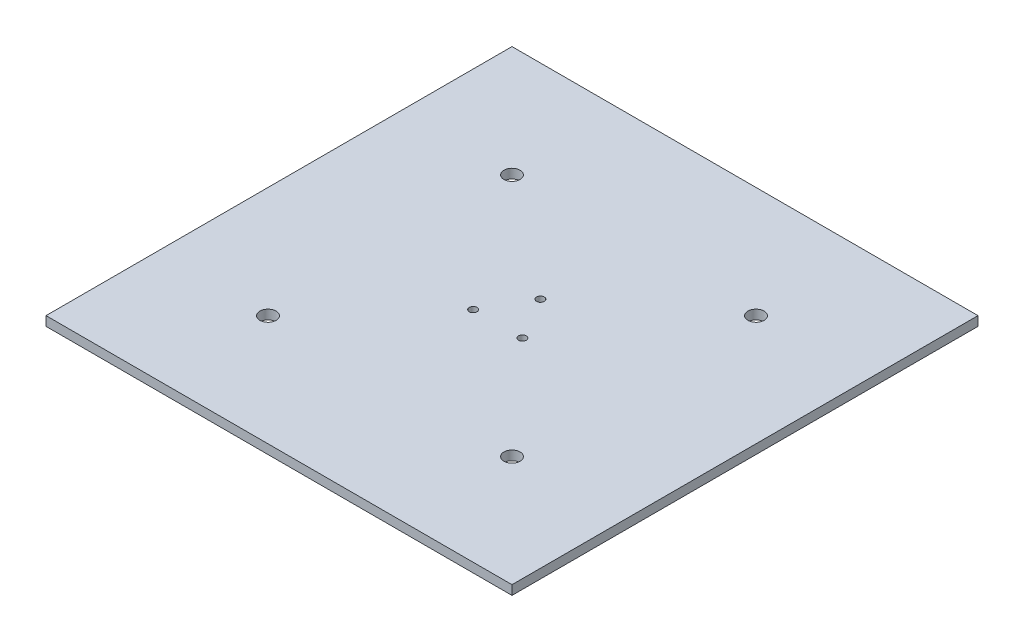
ISO-10303-21;
HEADER;
FILE_DESCRIPTION(('STEP AP214'),'2;1');
FILE_NAME('part.step','',(''),(''),'','','');
FILE_SCHEMA(('AUTOMOTIVE_DESIGN { 1 0 10303 214 1 1 1 1 }'));
ENDSEC;
DATA;
#1=APPLICATION_CONTEXT('core data for automotive mechanical design processes');
#2=APPLICATION_PROTOCOL_DEFINITION('international standard','automotive_design',2000,#1);
#3=PRODUCT_CONTEXT('',#1,'mechanical');
#4=PRODUCT('Part','Part','',(#3));
#5=PRODUCT_RELATED_PRODUCT_CATEGORY('part','',(#4));
#6=PRODUCT_DEFINITION_FORMATION('','',#4);
#7=PRODUCT_DEFINITION_CONTEXT('part definition',#1,'design');
#8=PRODUCT_DEFINITION('design','',#6,#7);
#9=PRODUCT_DEFINITION_SHAPE('','',#8);
#10=(LENGTH_UNIT() NAMED_UNIT(*) SI_UNIT(.MILLI.,.METRE.));
#11=(NAMED_UNIT(*) PLANE_ANGLE_UNIT() SI_UNIT($,.RADIAN.));
#12=(NAMED_UNIT(*) SI_UNIT($,.STERADIAN.) SOLID_ANGLE_UNIT());
#13=UNCERTAINTY_MEASURE_WITH_UNIT(LENGTH_MEASURE(1.E-05),#10,'distance_accuracy_value','');
#14=(GEOMETRIC_REPRESENTATION_CONTEXT(3) GLOBAL_UNCERTAINTY_ASSIGNED_CONTEXT((#13)) GLOBAL_UNIT_ASSIGNED_CONTEXT((#10,
#11,#12)) REPRESENTATION_CONTEXT('',''));
#15=CARTESIAN_POINT('',(0.,0.,0.));
#16=DIRECTION('',(0.,0.,1.));
#17=DIRECTION('',(1.,0.,0.));
#18=AXIS2_PLACEMENT_3D('',#15,#16,#17);
#19=CARTESIAN_POINT('',(127.,5.08,127.));
#20=DIRECTION('',(-1.,0.,0.));
#21=DIRECTION('',(0.,0.,1.));
#22=AXIS2_PLACEMENT_3D('',#19,#20,#21);
#23=PLANE('',#22);
#24=DIRECTION('',(0.,0.,-1.));
#25=VECTOR('',#24,1.);
#26=CARTESIAN_POINT('',(127.,0.,127.));
#27=LINE('',#26,#25);
#28=CARTESIAN_POINT('',(127.,0.,127.));
#29=VERTEX_POINT('',#28);
#30=CARTESIAN_POINT('',(127.,0.,-127.));
#31=VERTEX_POINT('',#30);
#32=EDGE_CURVE('E113',#29,#31,#27,.T.);
#33=ORIENTED_EDGE('',*,*,#32,.T.);
#34=DIRECTION('',(0.,-1.,0.));
#35=VECTOR('',#34,1.);
#36=CARTESIAN_POINT('',(127.,5.08,-127.));
#37=LINE('',#36,#35);
#38=CARTESIAN_POINT('',(127.,5.08,-127.));
#39=VERTEX_POINT('',#38);
#40=EDGE_CURVE('E11',#39,#31,#37,.T.);
#41=ORIENTED_EDGE('',*,*,#40,.F.);
#42=DIRECTION('',(0.,0.,-1.));
#43=VECTOR('',#42,1.);
#44=CARTESIAN_POINT('',(127.,5.08,127.));
#45=LINE('',#44,#43);
#46=CARTESIAN_POINT('',(127.,5.08,127.));
#47=VERTEX_POINT('',#46);
#48=EDGE_CURVE('E96',#47,#39,#45,.T.);
#49=ORIENTED_EDGE('',*,*,#48,.F.);
#50=DIRECTION('',(0.,-1.,0.));
#51=VECTOR('',#50,1.);
#52=CARTESIAN_POINT('',(127.,5.08,127.));
#53=LINE('',#52,#51);
#54=EDGE_CURVE('E109',#47,#29,#53,.T.);
#55=ORIENTED_EDGE('',*,*,#54,.T.);
#56=EDGE_LOOP('',(#33,#41,#49,#55));
#57=FACE_BOUND('',#56,.T.);
#58=ADVANCED_FACE('F44',(#57),#23,.F.);
#59=CARTESIAN_POINT('',(-127.,5.08,-127.));
#60=DIRECTION('',(0.,0.,1.));
#61=DIRECTION('',(1.,0.,0.));
#62=AXIS2_PLACEMENT_3D('',#59,#60,#61);
#63=PLANE('',#62);
#64=DIRECTION('',(-1.,0.,0.));
#65=VECTOR('',#64,1.);
#66=CARTESIAN_POINT('',(-127.,0.,-127.));
#67=LINE('',#66,#65);
#68=CARTESIAN_POINT('',(-127.,0.,-127.));
#69=VERTEX_POINT('',#68);
#70=EDGE_CURVE('E101',#31,#69,#67,.T.);
#71=ORIENTED_EDGE('',*,*,#70,.T.);
#72=DIRECTION('',(0.,-1.,0.));
#73=VECTOR('',#72,1.);
#74=CARTESIAN_POINT('',(-127.,5.08,-127.));
#75=LINE('',#74,#73);
#76=CARTESIAN_POINT('',(-127.,5.08,-127.));
#77=VERTEX_POINT('',#76);
#78=EDGE_CURVE('E53',#77,#69,#75,.T.);
#79=ORIENTED_EDGE('',*,*,#78,.F.);
#80=DIRECTION('',(-1.,0.,0.));
#81=VECTOR('',#80,1.);
#82=CARTESIAN_POINT('',(-127.,5.08,-127.));
#83=LINE('',#82,#81);
#84=EDGE_CURVE('E91',#39,#77,#83,.T.);
#85=ORIENTED_EDGE('',*,*,#84,.F.);
#86=ORIENTED_EDGE('',*,*,#40,.T.);
#87=EDGE_LOOP('',(#71,#79,#85,#86));
#88=FACE_BOUND('',#87,.T.);
#89=ADVANCED_FACE('F100',(#88),#63,.F.);
#90=CARTESIAN_POINT('',(-127.,5.08,127.));
#91=DIRECTION('',(1.,0.,0.));
#92=DIRECTION('',(0.,0.,-1.));
#93=AXIS2_PLACEMENT_3D('',#90,#91,#92);
#94=PLANE('',#93);
#95=DIRECTION('',(0.,0.,1.));
#96=VECTOR('',#95,1.);
#97=CARTESIAN_POINT('',(-127.,0.,127.));
#98=LINE('',#97,#96);
#99=CARTESIAN_POINT('',(-127.,0.,127.));
#100=VERTEX_POINT('',#99);
#101=EDGE_CURVE('E78',#69,#100,#98,.T.);
#102=ORIENTED_EDGE('',*,*,#101,.T.);
#103=DIRECTION('',(0.,-1.,0.));
#104=VECTOR('',#103,1.);
#105=CARTESIAN_POINT('',(-127.,5.08,127.));
#106=LINE('',#105,#104);
#107=CARTESIAN_POINT('',(-127.,5.08,127.));
#108=VERTEX_POINT('',#107);
#109=EDGE_CURVE('E103',#108,#100,#106,.T.);
#110=ORIENTED_EDGE('',*,*,#109,.F.);
#111=DIRECTION('',(0.,0.,1.));
#112=VECTOR('',#111,1.);
#113=CARTESIAN_POINT('',(-127.,5.08,127.));
#114=LINE('',#113,#112);
#115=EDGE_CURVE('E94',#77,#108,#114,.T.);
#116=ORIENTED_EDGE('',*,*,#115,.F.);
#117=ORIENTED_EDGE('',*,*,#78,.T.);
#118=EDGE_LOOP('',(#102,#110,#116,#117));
#119=FACE_BOUND('',#118,.T.);
#120=ADVANCED_FACE('F104',(#119),#94,.F.);
#121=CARTESIAN_POINT('',(-127.,5.08,127.));
#122=DIRECTION('',(0.,0.,-1.));
#123=DIRECTION('',(-1.,0.,0.));
#124=AXIS2_PLACEMENT_3D('',#121,#122,#123);
#125=PLANE('',#124);
#126=DIRECTION('',(1.,0.,0.));
#127=VECTOR('',#126,1.);
#128=CARTESIAN_POINT('',(-127.,0.,127.));
#129=LINE('',#128,#127);
#130=EDGE_CURVE('E84',#100,#29,#129,.T.);
#131=ORIENTED_EDGE('',*,*,#130,.T.);
#132=ORIENTED_EDGE('',*,*,#54,.F.);
#133=DIRECTION('',(1.,0.,0.));
#134=VECTOR('',#133,1.);
#135=CARTESIAN_POINT('',(-127.,5.08,127.));
#136=LINE('',#135,#134);
#137=EDGE_CURVE('E61',#108,#47,#136,.T.);
#138=ORIENTED_EDGE('',*,*,#137,.F.);
#139=ORIENTED_EDGE('',*,*,#109,.T.);
#140=EDGE_LOOP('',(#131,#132,#138,#139));
#141=FACE_BOUND('',#140,.T.);
#142=ADVANCED_FACE('F128',(#141),#125,.F.);
#143=CARTESIAN_POINT('',(0.,5.08,0.));
#144=DIRECTION('',(0.,-1.,0.));
#145=DIRECTION('',(0.,0.,-1.));
#146=AXIS2_PLACEMENT_3D('',#143,#144,#145);
#147=PLANE('',#146);
#148=CARTESIAN_POINT('',(66.5426980126111,5.08,66.5426980126114));
#149=DIRECTION('',(0.,1.,0.));
#150=DIRECTION('',(0.,0.,1.));
#151=AXIS2_PLACEMENT_3D('',#148,#149,#150);
#152=CIRCLE('',#151,4.39999996300001);
#153=CARTESIAN_POINT('',(66.5426980126111,5.08,70.9426979756114));
#154=VERTEX_POINT('',#153);
#155=EDGE_CURVE('E172',#154,#154,#152,.T.);
#156=ORIENTED_EDGE('',*,*,#155,.F.);
#157=EDGE_LOOP('',(#156));
#158=FACE_BOUND('',#157,.T.);
#159=CARTESIAN_POINT('',(-66.4572718999242,5.08,-66.457271899924));
#160=DIRECTION('',(0.,1.,0.));
#161=DIRECTION('',(0.,0.,1.));
#162=AXIS2_PLACEMENT_3D('',#159,#160,#161);
#163=CIRCLE('',#162,4.39999996300001);
#164=CARTESIAN_POINT('',(-66.4572718999242,5.08,-62.057271936924));
#165=VERTEX_POINT('',#164);
#166=EDGE_CURVE('E180',#165,#165,#163,.T.);
#167=ORIENTED_EDGE('',*,*,#166,.F.);
#168=EDGE_LOOP('',(#167));
#169=FACE_BOUND('',#168,.T.);
#170=CARTESIAN_POINT('',(-66.4572718999242,5.08,66.5426980126114));
#171=DIRECTION('',(0.,1.,0.));
#172=DIRECTION('',(0.,0.,1.));
#173=AXIS2_PLACEMENT_3D('',#170,#171,#172);
#174=CIRCLE('',#173,4.39999996300001);
#175=CARTESIAN_POINT('',(-66.4572718999242,5.08,70.9426979756114));
#176=VERTEX_POINT('',#175);
#177=EDGE_CURVE('E164',#176,#176,#174,.T.);
#178=ORIENTED_EDGE('',*,*,#177,.F.);
#179=EDGE_LOOP('',(#178));
#180=FACE_BOUND('',#179,.T.);
#181=CARTESIAN_POINT('',(66.5426980126111,5.08,-66.457271899924));
#182=DIRECTION('',(0.,1.,0.));
#183=DIRECTION('',(0.,0.,1.));
#184=AXIS2_PLACEMENT_3D('',#181,#182,#183);
#185=CIRCLE('',#184,4.39999996300001);
#186=CARTESIAN_POINT('',(66.5426980126111,5.08,-62.057271936924));
#187=VERTEX_POINT('',#186);
#188=EDGE_CURVE('E160',#187,#187,#185,.T.);
#189=ORIENTED_EDGE('',*,*,#188,.F.);
#190=EDGE_LOOP('',(#189));
#191=FACE_BOUND('',#190,.T.);
#192=CARTESIAN_POINT('',(-13.4233669118713,5.08,7.74998450000038));
#193=DIRECTION('',(0.,1.,0.));
#194=DIRECTION('',(0.,0.,1.));
#195=AXIS2_PLACEMENT_3D('',#192,#193,#194);
#196=CIRCLE('',#195,2.10058000000039);
#197=CARTESIAN_POINT('',(-13.4233669118713,5.08,9.85056450000077));
#198=VERTEX_POINT('',#197);
#199=EDGE_CURVE('E153',#198,#198,#196,.T.);
#200=ORIENTED_EDGE('',*,*,#199,.F.);
#201=EDGE_LOOP('',(#200));
#202=FACE_BOUND('',#201,.T.);
#203=CARTESIAN_POINT('',(13.4233669118716,5.08,7.74998450000019));
#204=DIRECTION('',(0.,1.,0.));
#205=DIRECTION('',(0.,0.,1.));
#206=AXIS2_PLACEMENT_3D('',#203,#204,#205);
#207=CIRCLE('',#206,2.10057999999996);
#208=CARTESIAN_POINT('',(13.4233669118716,5.08,9.85056450000015));
#209=VERTEX_POINT('',#208);
#210=EDGE_CURVE('E149',#209,#209,#207,.T.);
#211=ORIENTED_EDGE('',*,*,#210,.F.);
#212=EDGE_LOOP('',(#211));
#213=FACE_BOUND('',#212,.T.);
#214=CARTESIAN_POINT('',(0.,5.08,-15.499969));
#215=DIRECTION('',(0.,1.,0.));
#216=DIRECTION('',(0.,0.,1.));
#217=AXIS2_PLACEMENT_3D('',#214,#215,#216);
#218=CIRCLE('',#217,2.10058);
#219=CARTESIAN_POINT('',(0.,5.08,-13.399389));
#220=VERTEX_POINT('',#219);
#221=EDGE_CURVE('E140',#220,#220,#218,.T.);
#222=ORIENTED_EDGE('',*,*,#221,.F.);
#223=EDGE_LOOP('',(#222));
#224=FACE_BOUND('',#223,.T.);
#225=ORIENTED_EDGE('',*,*,#48,.T.);
#226=ORIENTED_EDGE('',*,*,#84,.T.);
#227=ORIENTED_EDGE('',*,*,#115,.T.);
#228=ORIENTED_EDGE('',*,*,#137,.T.);
#229=EDGE_LOOP('',(#225,#226,#227,#228));
#230=FACE_BOUND('',#229,.T.);
#231=ADVANCED_FACE('F92',(#158,#169,#180,#191,#202,#213,#224,#230),#147,.F.);
#232=CARTESIAN_POINT('',(0.,0.,0.));
#233=DIRECTION('',(0.,-1.,0.));
#234=DIRECTION('',(0.,0.,-1.));
#235=AXIS2_PLACEMENT_3D('',#232,#233,#234);
#236=PLANE('',#235);
#237=CARTESIAN_POINT('',(66.5426980126111,0.,66.5426980126114));
#238=DIRECTION('',(0.,1.,0.));
#239=DIRECTION('',(0.,0.,1.));
#240=AXIS2_PLACEMENT_3D('',#237,#238,#239);
#241=CIRCLE('',#240,4.39999996300001);
#242=CARTESIAN_POINT('',(66.5426980126111,0.,70.9426979756114));
#243=VERTEX_POINT('',#242);
#244=EDGE_CURVE('E168',#243,#243,#241,.T.);
#245=ORIENTED_EDGE('',*,*,#244,.T.);
#246=EDGE_LOOP('',(#245));
#247=FACE_BOUND('',#246,.T.);
#248=CARTESIAN_POINT('',(-66.4572718999242,0.,-66.457271899924));
#249=DIRECTION('',(0.,1.,0.));
#250=DIRECTION('',(0.,0.,1.));
#251=AXIS2_PLACEMENT_3D('',#248,#249,#250);
#252=CIRCLE('',#251,4.39999996300001);
#253=CARTESIAN_POINT('',(-66.4572718999242,0.,-62.057271936924));
#254=VERTEX_POINT('',#253);
#255=EDGE_CURVE('E176',#254,#254,#252,.T.);
#256=ORIENTED_EDGE('',*,*,#255,.T.);
#257=EDGE_LOOP('',(#256));
#258=FACE_BOUND('',#257,.T.);
#259=CARTESIAN_POINT('',(-66.4572718999242,0.,66.5426980126114));
#260=DIRECTION('',(0.,1.,0.));
#261=DIRECTION('',(0.,0.,1.));
#262=AXIS2_PLACEMENT_3D('',#259,#260,#261);
#263=CIRCLE('',#262,4.39999996300001);
#264=CARTESIAN_POINT('',(-66.4572718999242,0.,70.9426979756114));
#265=VERTEX_POINT('',#264);
#266=EDGE_CURVE('E184',#265,#265,#263,.T.);
#267=ORIENTED_EDGE('',*,*,#266,.T.);
#268=EDGE_LOOP('',(#267));
#269=FACE_BOUND('',#268,.T.);
#270=CARTESIAN_POINT('',(66.5426980126111,0.,-66.457271899924));
#271=DIRECTION('',(0.,1.,0.));
#272=DIRECTION('',(0.,0.,1.));
#273=AXIS2_PLACEMENT_3D('',#270,#271,#272);
#274=CIRCLE('',#273,4.39999996300001);
#275=CARTESIAN_POINT('',(66.5426980126111,0.,-62.057271936924));
#276=VERTEX_POINT('',#275);
#277=EDGE_CURVE('E141',#276,#276,#274,.T.);
#278=ORIENTED_EDGE('',*,*,#277,.T.);
#279=EDGE_LOOP('',(#278));
#280=FACE_BOUND('',#279,.T.);
#281=CARTESIAN_POINT('',(-13.4233669118713,0.,7.74998450000038));
#282=DIRECTION('',(0.,1.,0.));
#283=DIRECTION('',(0.,0.,1.));
#284=AXIS2_PLACEMENT_3D('',#281,#282,#283);
#285=CIRCLE('',#284,2.10058000000039);
#286=CARTESIAN_POINT('',(-13.4233669118713,0.,9.85056450000077));
#287=VERTEX_POINT('',#286);
#288=EDGE_CURVE('E117',#287,#287,#285,.T.);
#289=ORIENTED_EDGE('',*,*,#288,.T.);
#290=EDGE_LOOP('',(#289));
#291=FACE_BOUND('',#290,.T.);
#292=CARTESIAN_POINT('',(13.4233669118716,0.,7.74998450000019));
#293=DIRECTION('',(0.,1.,0.));
#294=DIRECTION('',(0.,0.,1.));
#295=AXIS2_PLACEMENT_3D('',#292,#293,#294);
#296=CIRCLE('',#295,2.10057999999996);
#297=CARTESIAN_POINT('',(13.4233669118716,0.,9.85056450000015));
#298=VERTEX_POINT('',#297);
#299=EDGE_CURVE('E145',#298,#298,#296,.T.);
#300=ORIENTED_EDGE('',*,*,#299,.T.);
#301=EDGE_LOOP('',(#300));
#302=FACE_BOUND('',#301,.T.);
#303=CARTESIAN_POINT('',(0.,0.,-15.499969));
#304=DIRECTION('',(0.,1.,0.));
#305=DIRECTION('',(0.,0.,1.));
#306=AXIS2_PLACEMENT_3D('',#303,#304,#305);
#307=CIRCLE('',#306,2.10058);
#308=CARTESIAN_POINT('',(0.,0.,-13.399389));
#309=VERTEX_POINT('',#308);
#310=EDGE_CURVE('E136',#309,#309,#307,.T.);
#311=ORIENTED_EDGE('',*,*,#310,.T.);
#312=EDGE_LOOP('',(#311));
#313=FACE_BOUND('',#312,.T.);
#314=ORIENTED_EDGE('',*,*,#32,.F.);
#315=ORIENTED_EDGE('',*,*,#130,.F.);
#316=ORIENTED_EDGE('',*,*,#101,.F.);
#317=ORIENTED_EDGE('',*,*,#70,.F.);
#318=EDGE_LOOP('',(#314,#315,#316,#317));
#319=FACE_BOUND('',#318,.T.);
#320=ADVANCED_FACE('F131',(#247,#258,#269,#280,#291,#302,#313,#319),#236,.T.);
#321=CARTESIAN_POINT('',(0.,0.,-15.499969));
#322=DIRECTION('',(0.,1.,0.));
#323=DIRECTION('',(0.,0.,1.));
#324=AXIS2_PLACEMENT_3D('',#321,#322,#323);
#325=CYLINDRICAL_SURFACE('',#324,2.10058);
#326=ORIENTED_EDGE('',*,*,#310,.F.);
#327=EDGE_LOOP('',(#326));
#328=FACE_BOUND('',#327,.T.);
#329=ORIENTED_EDGE('',*,*,#221,.T.);
#330=EDGE_LOOP('',(#329));
#331=FACE_BOUND('',#330,.T.);
#332=ADVANCED_FACE('F207',(#328,#331),#325,.F.);
#333=CARTESIAN_POINT('',(13.4233669118716,0.,7.74998450000019));
#334=DIRECTION('',(0.,1.,0.));
#335=DIRECTION('',(0.,0.,1.));
#336=AXIS2_PLACEMENT_3D('',#333,#334,#335);
#337=CYLINDRICAL_SURFACE('',#336,2.10057999999996);
#338=ORIENTED_EDGE('',*,*,#299,.F.);
#339=EDGE_LOOP('',(#338));
#340=FACE_BOUND('',#339,.T.);
#341=ORIENTED_EDGE('',*,*,#210,.T.);
#342=EDGE_LOOP('',(#341));
#343=FACE_BOUND('',#342,.T.);
#344=ADVANCED_FACE('F209',(#340,#343),#337,.F.);
#345=CARTESIAN_POINT('',(-13.4233669118713,0.,7.74998450000038));
#346=DIRECTION('',(0.,1.,0.));
#347=DIRECTION('',(0.,0.,1.));
#348=AXIS2_PLACEMENT_3D('',#345,#346,#347);
#349=CYLINDRICAL_SURFACE('',#348,2.10058000000039);
#350=ORIENTED_EDGE('',*,*,#288,.F.);
#351=EDGE_LOOP('',(#350));
#352=FACE_BOUND('',#351,.T.);
#353=ORIENTED_EDGE('',*,*,#199,.T.);
#354=EDGE_LOOP('',(#353));
#355=FACE_BOUND('',#354,.T.);
#356=ADVANCED_FACE('F216',(#352,#355),#349,.F.);
#357=CARTESIAN_POINT('',(66.5426980126111,0.,-66.457271899924));
#358=DIRECTION('',(0.,1.,0.));
#359=DIRECTION('',(0.,0.,1.));
#360=AXIS2_PLACEMENT_3D('',#357,#358,#359);
#361=CYLINDRICAL_SURFACE('',#360,4.39999996300001);
#362=ORIENTED_EDGE('',*,*,#277,.F.);
#363=EDGE_LOOP('',(#362));
#364=FACE_BOUND('',#363,.T.);
#365=ORIENTED_EDGE('',*,*,#188,.T.);
#366=EDGE_LOOP('',(#365));
#367=FACE_BOUND('',#366,.T.);
#368=ADVANCED_FACE('F276',(#364,#367),#361,.F.);
#369=CARTESIAN_POINT('',(-66.4572718999242,0.,66.5426980126114));
#370=DIRECTION('',(0.,1.,0.));
#371=DIRECTION('',(0.,0.,1.));
#372=AXIS2_PLACEMENT_3D('',#369,#370,#371);
#373=CYLINDRICAL_SURFACE('',#372,4.39999996300001);
#374=ORIENTED_EDGE('',*,*,#266,.F.);
#375=EDGE_LOOP('',(#374));
#376=FACE_BOUND('',#375,.T.);
#377=ORIENTED_EDGE('',*,*,#177,.T.);
#378=EDGE_LOOP('',(#377));
#379=FACE_BOUND('',#378,.T.);
#380=ADVANCED_FACE('F193',(#376,#379),#373,.F.);
#381=CARTESIAN_POINT('',(-66.4572718999242,0.,-66.457271899924));
#382=DIRECTION('',(0.,1.,0.));
#383=DIRECTION('',(0.,0.,1.));
#384=AXIS2_PLACEMENT_3D('',#381,#382,#383);
#385=CYLINDRICAL_SURFACE('',#384,4.39999996300001);
#386=ORIENTED_EDGE('',*,*,#255,.F.);
#387=EDGE_LOOP('',(#386));
#388=FACE_BOUND('',#387,.T.);
#389=ORIENTED_EDGE('',*,*,#166,.T.);
#390=EDGE_LOOP('',(#389));
#391=FACE_BOUND('',#390,.T.);
#392=ADVANCED_FACE('F293',(#388,#391),#385,.F.);
#393=CARTESIAN_POINT('',(66.5426980126111,0.,66.5426980126114));
#394=DIRECTION('',(0.,1.,0.));
#395=DIRECTION('',(0.,0.,1.));
#396=AXIS2_PLACEMENT_3D('',#393,#394,#395);
#397=CYLINDRICAL_SURFACE('',#396,4.39999996300001);
#398=ORIENTED_EDGE('',*,*,#244,.F.);
#399=EDGE_LOOP('',(#398));
#400=FACE_BOUND('',#399,.T.);
#401=ORIENTED_EDGE('',*,*,#155,.T.);
#402=EDGE_LOOP('',(#401));
#403=FACE_BOUND('',#402,.T.);
#404=ADVANCED_FACE('F302',(#400,#403),#397,.F.);
#405=CLOSED_SHELL('',(#58,#89,#120,#142,#231,#320,#332,#344,#356,#368,#380,#392,#404));
#406=MANIFOLD_SOLID_BREP('B2',#405);
#407=ADVANCED_BREP_SHAPE_REPRESENTATION('',(#18,#406),#14);
#408=SHAPE_DEFINITION_REPRESENTATION(#9,#407);
ENDSEC;
END-ISO-10303-21;
